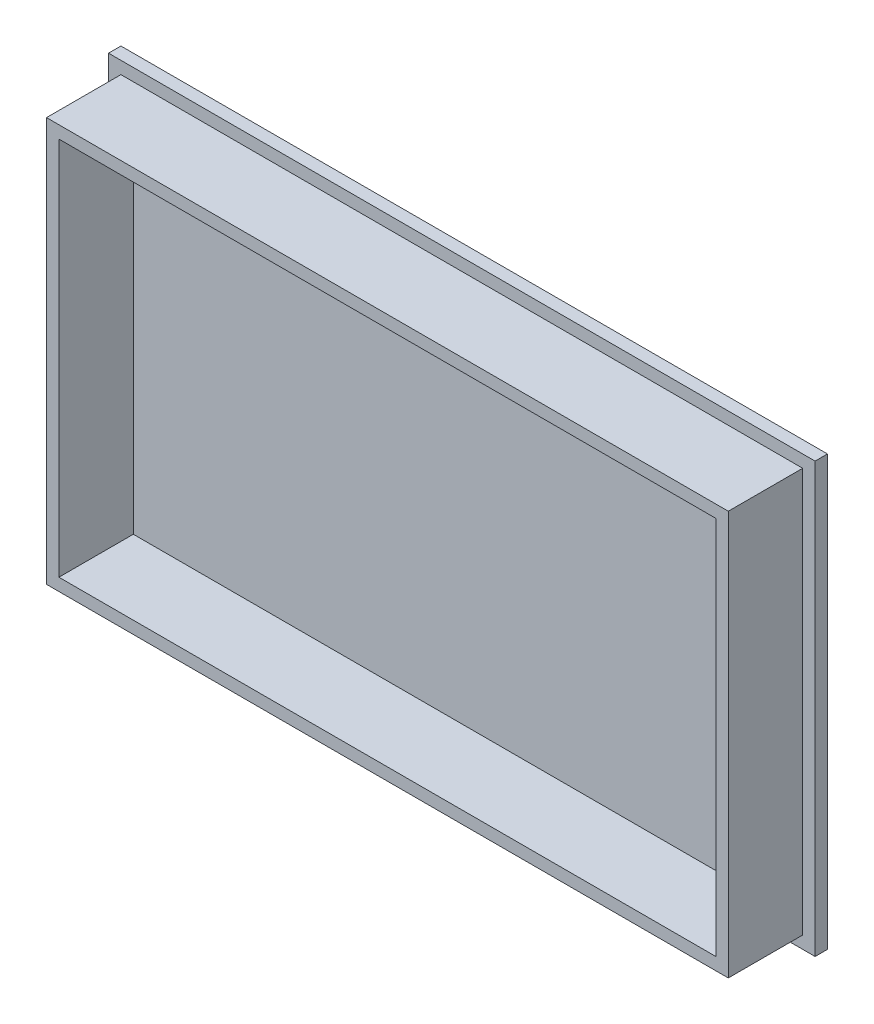
ISO-10303-21;
HEADER;
FILE_DESCRIPTION(('STEP AP214'),'2;1');
FILE_NAME('part.step','',(''),(''),'','','');
FILE_SCHEMA(('AUTOMOTIVE_DESIGN { 1 0 10303 214 1 1 1 1 }'));
ENDSEC;
DATA;
#1=APPLICATION_CONTEXT('core data for automotive mechanical design processes');
#2=APPLICATION_PROTOCOL_DEFINITION('international standard','automotive_design',2000,#1);
#3=PRODUCT_CONTEXT('',#1,'mechanical');
#4=PRODUCT('Part','Part','',(#3));
#5=PRODUCT_RELATED_PRODUCT_CATEGORY('part','',(#4));
#6=PRODUCT_DEFINITION_FORMATION('','',#4);
#7=PRODUCT_DEFINITION_CONTEXT('part definition',#1,'design');
#8=PRODUCT_DEFINITION('design','',#6,#7);
#9=PRODUCT_DEFINITION_SHAPE('','',#8);
#10=(LENGTH_UNIT() NAMED_UNIT(*) SI_UNIT(.MILLI.,.METRE.));
#11=(NAMED_UNIT(*) PLANE_ANGLE_UNIT() SI_UNIT($,.RADIAN.));
#12=(NAMED_UNIT(*) SI_UNIT($,.STERADIAN.) SOLID_ANGLE_UNIT());
#13=UNCERTAINTY_MEASURE_WITH_UNIT(LENGTH_MEASURE(1.E-05),#10,'distance_accuracy_value','');
#14=(GEOMETRIC_REPRESENTATION_CONTEXT(3) GLOBAL_UNCERTAINTY_ASSIGNED_CONTEXT((#13)) GLOBAL_UNIT_ASSIGNED_CONTEXT((#10,
#11,#12)) REPRESENTATION_CONTEXT('',''));
#15=CARTESIAN_POINT('',(0.,0.,0.));
#16=DIRECTION('',(0.,0.,1.));
#17=DIRECTION('',(1.,0.,0.));
#18=AXIS2_PLACEMENT_3D('',#15,#16,#17);
#19=CARTESIAN_POINT('',(-136.627057201795,69.8390557939914,5.));
#20=DIRECTION('',(1.,0.,0.));
#21=DIRECTION('',(0.,1.,0.));
#22=AXIS2_PLACEMENT_3D('',#19,#20,#21);
#23=PLANE('',#22);
#24=DIRECTION('',(0.,-1.,0.));
#25=VECTOR('',#24,1.);
#26=CARTESIAN_POINT('',(-136.627057201795,69.8390557939914,0.));
#27=LINE('',#26,#25);
#28=CARTESIAN_POINT('',(-136.627057201795,69.8390557939914,0.));
#29=VERTEX_POINT('',#28);
#30=CARTESIAN_POINT('',(-136.627057201795,-103.160944206009,0.));
#31=VERTEX_POINT('',#30);
#32=EDGE_CURVE('E224',#29,#31,#27,.T.);
#33=ORIENTED_EDGE('',*,*,#32,.T.);
#34=DIRECTION('',(0.,0.,-1.));
#35=VECTOR('',#34,1.);
#36=CARTESIAN_POINT('',(-136.627057201795,-103.160944206009,5.));
#37=LINE('',#36,#35);
#38=CARTESIAN_POINT('',(-136.627057201795,-103.160944206009,5.));
#39=VERTEX_POINT('',#38);
#40=EDGE_CURVE('E11',#39,#31,#37,.T.);
#41=ORIENTED_EDGE('',*,*,#40,.F.);
#42=DIRECTION('',(0.,-1.,0.));
#43=VECTOR('',#42,1.);
#44=CARTESIAN_POINT('',(-136.627057201795,69.8390557939914,5.));
#45=LINE('',#44,#43);
#46=CARTESIAN_POINT('',(-136.627057201795,69.8390557939914,5.));
#47=VERTEX_POINT('',#46);
#48=EDGE_CURVE('E225',#47,#39,#45,.T.);
#49=ORIENTED_EDGE('',*,*,#48,.F.);
#50=DIRECTION('',(0.,0.,-1.));
#51=VECTOR('',#50,1.);
#52=CARTESIAN_POINT('',(-136.627057201795,69.8390557939914,5.));
#53=LINE('',#52,#51);
#54=EDGE_CURVE('E239',#47,#29,#53,.T.);
#55=ORIENTED_EDGE('',*,*,#54,.T.);
#56=EDGE_LOOP('',(#33,#41,#49,#55));
#57=FACE_BOUND('',#56,.T.);
#58=ADVANCED_FACE('F43',(#57),#23,.F.);
#59=CARTESIAN_POINT('',(-136.627057201795,-103.160944206009,5.));
#60=DIRECTION('',(0.,1.,0.));
#61=DIRECTION('',(0.,0.,1.));
#62=AXIS2_PLACEMENT_3D('',#59,#60,#61);
#63=PLANE('',#62);
#64=DIRECTION('',(1.,0.,0.));
#65=VECTOR('',#64,1.);
#66=CARTESIAN_POINT('',(-136.627057201795,-103.160944206009,0.));
#67=LINE('',#66,#65);
#68=CARTESIAN_POINT('',(148.272942798205,-103.160944206009,0.));
#69=VERTEX_POINT('',#68);
#70=EDGE_CURVE('E243',#31,#69,#67,.T.);
#71=ORIENTED_EDGE('',*,*,#70,.T.);
#72=DIRECTION('',(0.,0.,-1.));
#73=VECTOR('',#72,1.);
#74=CARTESIAN_POINT('',(148.272942798205,-103.160944206009,5.));
#75=LINE('',#74,#73);
#76=CARTESIAN_POINT('',(148.272942798205,-103.160944206009,5.));
#77=VERTEX_POINT('',#76);
#78=EDGE_CURVE('E51',#77,#69,#75,.T.);
#79=ORIENTED_EDGE('',*,*,#78,.F.);
#80=DIRECTION('',(1.,0.,0.));
#81=VECTOR('',#80,1.);
#82=CARTESIAN_POINT('',(-136.627057201795,-103.160944206009,5.));
#83=LINE('',#82,#81);
#84=EDGE_CURVE('E229',#39,#77,#83,.T.);
#85=ORIENTED_EDGE('',*,*,#84,.F.);
#86=ORIENTED_EDGE('',*,*,#40,.T.);
#87=EDGE_LOOP('',(#71,#79,#85,#86));
#88=FACE_BOUND('',#87,.T.);
#89=ADVANCED_FACE('F279',(#88),#63,.F.);
#90=CARTESIAN_POINT('',(148.272942798205,69.8390557939914,5.));
#91=DIRECTION('',(-1.,0.,0.));
#92=DIRECTION('',(0.,0.,1.));
#93=AXIS2_PLACEMENT_3D('',#90,#91,#92);
#94=PLANE('',#93);
#95=DIRECTION('',(0.,1.,0.));
#96=VECTOR('',#95,1.);
#97=CARTESIAN_POINT('',(148.272942798205,69.8390557939914,0.));
#98=LINE('',#97,#96);
#99=CARTESIAN_POINT('',(148.272942798205,69.8390557939914,0.));
#100=VERTEX_POINT('',#99);
#101=EDGE_CURVE('E246',#69,#100,#98,.T.);
#102=ORIENTED_EDGE('',*,*,#101,.T.);
#103=DIRECTION('',(0.,0.,-1.));
#104=VECTOR('',#103,1.);
#105=CARTESIAN_POINT('',(148.272942798205,69.8390557939914,5.));
#106=LINE('',#105,#104);
#107=CARTESIAN_POINT('',(148.272942798205,69.8390557939914,5.));
#108=VERTEX_POINT('',#107);
#109=EDGE_CURVE('E254',#108,#100,#106,.T.);
#110=ORIENTED_EDGE('',*,*,#109,.F.);
#111=DIRECTION('',(0.,1.,0.));
#112=VECTOR('',#111,1.);
#113=CARTESIAN_POINT('',(148.272942798205,69.8390557939914,5.));
#114=LINE('',#113,#112);
#115=EDGE_CURVE('E233',#77,#108,#114,.T.);
#116=ORIENTED_EDGE('',*,*,#115,.F.);
#117=ORIENTED_EDGE('',*,*,#78,.T.);
#118=EDGE_LOOP('',(#102,#110,#116,#117));
#119=FACE_BOUND('',#118,.T.);
#120=ADVANCED_FACE('F263',(#119),#94,.F.);
#121=CARTESIAN_POINT('',(-136.627057201795,69.8390557939914,5.));
#122=DIRECTION('',(0.,-1.,0.));
#123=DIRECTION('',(0.,0.,-1.));
#124=AXIS2_PLACEMENT_3D('',#121,#122,#123);
#125=PLANE('',#124);
#126=DIRECTION('',(-1.,0.,0.));
#127=VECTOR('',#126,1.);
#128=CARTESIAN_POINT('',(-136.627057201795,69.8390557939914,0.));
#129=LINE('',#128,#127);
#130=EDGE_CURVE('E230',#100,#29,#129,.T.);
#131=ORIENTED_EDGE('',*,*,#130,.T.);
#132=ORIENTED_EDGE('',*,*,#54,.F.);
#133=DIRECTION('',(-1.,0.,0.));
#134=VECTOR('',#133,1.);
#135=CARTESIAN_POINT('',(-136.627057201795,69.8390557939914,5.));
#136=LINE('',#135,#134);
#137=EDGE_CURVE('E236',#108,#47,#136,.T.);
#138=ORIENTED_EDGE('',*,*,#137,.F.);
#139=ORIENTED_EDGE('',*,*,#109,.T.);
#140=EDGE_LOOP('',(#131,#132,#138,#139));
#141=FACE_BOUND('',#140,.T.);
#142=ADVANCED_FACE('F272',(#141),#125,.F.);
#143=CARTESIAN_POINT('',(0.,0.,5.));
#144=DIRECTION('',(0.,0.,1.));
#145=DIRECTION('',(1.,0.,0.));
#146=AXIS2_PLACEMENT_3D('',#143,#144,#145);
#147=PLANE('',#146);
#148=DIRECTION('',(0.,-1.,0.));
#149=VECTOR('',#148,1.);
#150=CARTESIAN_POINT('',(-131.627057201795,64.8390557939914,5.));
#151=LINE('',#150,#149);
#152=CARTESIAN_POINT('',(-131.627057201795,64.8390557939914,5.));
#153=VERTEX_POINT('',#152);
#154=CARTESIAN_POINT('',(-131.627057201795,-98.1609442060086,5.));
#155=VERTEX_POINT('',#154);
#156=EDGE_CURVE('E66',#153,#155,#151,.T.);
#157=ORIENTED_EDGE('',*,*,#156,.F.);
#158=DIRECTION('',(-1.,0.,0.));
#159=VECTOR('',#158,1.);
#160=CARTESIAN_POINT('',(-131.627057201795,64.8390557939914,5.));
#161=LINE('',#160,#159);
#162=CARTESIAN_POINT('',(143.272942798205,64.8390557939914,5.));
#163=VERTEX_POINT('',#162);
#164=EDGE_CURVE('E187',#163,#153,#161,.T.);
#165=ORIENTED_EDGE('',*,*,#164,.F.);
#166=DIRECTION('',(0.,1.,0.));
#167=VECTOR('',#166,1.);
#168=CARTESIAN_POINT('',(143.272942798205,64.8390557939914,5.));
#169=LINE('',#168,#167);
#170=CARTESIAN_POINT('',(143.272942798205,-98.1609442060086,5.));
#171=VERTEX_POINT('',#170);
#172=EDGE_CURVE('E203',#171,#163,#169,.T.);
#173=ORIENTED_EDGE('',*,*,#172,.F.);
#174=DIRECTION('',(1.,0.,0.));
#175=VECTOR('',#174,1.);
#176=CARTESIAN_POINT('',(-131.627057201795,-98.1609442060086,5.));
#177=LINE('',#176,#175);
#178=EDGE_CURVE('E199',#155,#171,#177,.T.);
#179=ORIENTED_EDGE('',*,*,#178,.F.);
#180=EDGE_LOOP('',(#157,#165,#173,#179));
#181=FACE_BOUND('',#180,.T.);
#182=ORIENTED_EDGE('',*,*,#48,.T.);
#183=ORIENTED_EDGE('',*,*,#84,.T.);
#184=ORIENTED_EDGE('',*,*,#115,.T.);
#185=ORIENTED_EDGE('',*,*,#137,.T.);
#186=EDGE_LOOP('',(#182,#183,#184,#185));
#187=FACE_BOUND('',#186,.T.);
#188=ADVANCED_FACE('F278',(#181,#187),#147,.T.);
#189=CARTESIAN_POINT('',(0.,0.,0.));
#190=DIRECTION('',(0.,0.,1.));
#191=DIRECTION('',(1.,0.,0.));
#192=AXIS2_PLACEMENT_3D('',#189,#190,#191);
#193=PLANE('',#192);
#194=ORIENTED_EDGE('',*,*,#32,.F.);
#195=ORIENTED_EDGE('',*,*,#130,.F.);
#196=ORIENTED_EDGE('',*,*,#101,.F.);
#197=ORIENTED_EDGE('',*,*,#70,.F.);
#198=EDGE_LOOP('',(#194,#195,#196,#197));
#199=FACE_BOUND('',#198,.T.);
#200=ADVANCED_FACE('F269',(#199),#193,.F.);
#201=CARTESIAN_POINT('',(-131.627057201795,64.8390557939914,35.));
#202=DIRECTION('',(1.,0.,0.));
#203=DIRECTION('',(0.,1.,0.));
#204=AXIS2_PLACEMENT_3D('',#201,#202,#203);
#205=PLANE('',#204);
#206=ORIENTED_EDGE('',*,*,#156,.T.);
#207=DIRECTION('',(0.,0.,-1.));
#208=VECTOR('',#207,1.);
#209=CARTESIAN_POINT('',(-131.627057201795,-98.1609442060086,35.));
#210=LINE('',#209,#208);
#211=CARTESIAN_POINT('',(-131.627057201795,-98.1609442060086,35.));
#212=VERTEX_POINT('',#211);
#213=EDGE_CURVE('E220',#212,#155,#210,.T.);
#214=ORIENTED_EDGE('',*,*,#213,.F.);
#215=DIRECTION('',(0.,-1.,0.));
#216=VECTOR('',#215,1.);
#217=CARTESIAN_POINT('',(-131.627057201795,64.8390557939914,35.));
#218=LINE('',#217,#216);
#219=CARTESIAN_POINT('',(-131.627057201795,64.8390557939914,35.));
#220=VERTEX_POINT('',#219);
#221=EDGE_CURVE('E182',#220,#212,#218,.T.);
#222=ORIENTED_EDGE('',*,*,#221,.F.);
#223=DIRECTION('',(0.,0.,-1.));
#224=VECTOR('',#223,1.);
#225=CARTESIAN_POINT('',(-131.627057201795,64.8390557939914,35.));
#226=LINE('',#225,#224);
#227=EDGE_CURVE('E196',#220,#153,#226,.T.);
#228=ORIENTED_EDGE('',*,*,#227,.T.);
#229=EDGE_LOOP('',(#206,#214,#222,#228));
#230=FACE_BOUND('',#229,.T.);
#231=ADVANCED_FACE('F291',(#230),#205,.F.);
#232=CARTESIAN_POINT('',(-131.627057201795,-98.1609442060086,35.));
#233=DIRECTION('',(0.,1.,0.));
#234=DIRECTION('',(0.,0.,1.));
#235=AXIS2_PLACEMENT_3D('',#232,#233,#234);
#236=PLANE('',#235);
#237=ORIENTED_EDGE('',*,*,#178,.T.);
#238=DIRECTION('',(0.,0.,-1.));
#239=VECTOR('',#238,1.);
#240=CARTESIAN_POINT('',(143.272942798205,-98.1609442060086,35.));
#241=LINE('',#240,#239);
#242=CARTESIAN_POINT('',(143.272942798205,-98.1609442060086,35.));
#243=VERTEX_POINT('',#242);
#244=EDGE_CURVE('E216',#243,#171,#241,.T.);
#245=ORIENTED_EDGE('',*,*,#244,.F.);
#246=DIRECTION('',(1.,0.,0.));
#247=VECTOR('',#246,1.);
#248=CARTESIAN_POINT('',(-131.627057201795,-98.1609442060086,35.));
#249=LINE('',#248,#247);
#250=EDGE_CURVE('E186',#212,#243,#249,.T.);
#251=ORIENTED_EDGE('',*,*,#250,.F.);
#252=ORIENTED_EDGE('',*,*,#213,.T.);
#253=EDGE_LOOP('',(#237,#245,#251,#252));
#254=FACE_BOUND('',#253,.T.);
#255=ADVANCED_FACE('F296',(#254),#236,.F.);
#256=CARTESIAN_POINT('',(143.272942798205,64.8390557939914,35.));
#257=DIRECTION('',(-1.,0.,0.));
#258=DIRECTION('',(0.,-1.,0.));
#259=AXIS2_PLACEMENT_3D('',#256,#257,#258);
#260=PLANE('',#259);
#261=ORIENTED_EDGE('',*,*,#172,.T.);
#262=DIRECTION('',(0.,0.,-1.));
#263=VECTOR('',#262,1.);
#264=CARTESIAN_POINT('',(143.272942798205,64.8390557939914,35.));
#265=LINE('',#264,#263);
#266=CARTESIAN_POINT('',(143.272942798205,64.8390557939914,35.));
#267=VERTEX_POINT('',#266);
#268=EDGE_CURVE('E212',#267,#163,#265,.T.);
#269=ORIENTED_EDGE('',*,*,#268,.F.);
#270=DIRECTION('',(0.,1.,0.));
#271=VECTOR('',#270,1.);
#272=CARTESIAN_POINT('',(143.272942798205,64.8390557939914,35.));
#273=LINE('',#272,#271);
#274=EDGE_CURVE('E190',#243,#267,#273,.T.);
#275=ORIENTED_EDGE('',*,*,#274,.F.);
#276=ORIENTED_EDGE('',*,*,#244,.T.);
#277=EDGE_LOOP('',(#261,#269,#275,#276));
#278=FACE_BOUND('',#277,.T.);
#279=ADVANCED_FACE('F300',(#278),#260,.F.);
#280=CARTESIAN_POINT('',(-131.627057201795,64.8390557939914,35.));
#281=DIRECTION('',(0.,-1.,0.));
#282=DIRECTION('',(0.,0.,-1.));
#283=AXIS2_PLACEMENT_3D('',#280,#281,#282);
#284=PLANE('',#283);
#285=ORIENTED_EDGE('',*,*,#164,.T.);
#286=ORIENTED_EDGE('',*,*,#227,.F.);
#287=DIRECTION('',(-1.,0.,0.));
#288=VECTOR('',#287,1.);
#289=CARTESIAN_POINT('',(-131.627057201795,64.8390557939914,35.));
#290=LINE('',#289,#288);
#291=EDGE_CURVE('E193',#267,#220,#290,.T.);
#292=ORIENTED_EDGE('',*,*,#291,.F.);
#293=ORIENTED_EDGE('',*,*,#268,.T.);
#294=EDGE_LOOP('',(#285,#286,#292,#293));
#295=FACE_BOUND('',#294,.T.);
#296=ADVANCED_FACE('F304',(#295),#284,.F.);
#297=CARTESIAN_POINT('',(0.,0.,35.));
#298=DIRECTION('',(0.,0.,1.));
#299=DIRECTION('',(1.,0.,0.));
#300=AXIS2_PLACEMENT_3D('',#297,#298,#299);
#301=PLANE('',#300);
#302=DIRECTION('',(0.,-1.,0.));
#303=VECTOR('',#302,1.);
#304=CARTESIAN_POINT('',(-126.627057201795,59.8390557939914,35.));
#305=LINE('',#304,#303);
#306=CARTESIAN_POINT('',(-126.627057201795,59.8390557939914,35.));
#307=VERTEX_POINT('',#306);
#308=CARTESIAN_POINT('',(-126.627057201795,-93.1609442060086,35.));
#309=VERTEX_POINT('',#308);
#310=EDGE_CURVE('E58',#307,#309,#305,.T.);
#311=ORIENTED_EDGE('',*,*,#310,.F.);
#312=DIRECTION('',(-1.,0.,0.));
#313=VECTOR('',#312,1.);
#314=CARTESIAN_POINT('',(-126.627057201795,59.8390557939914,35.));
#315=LINE('',#314,#313);
#316=CARTESIAN_POINT('',(138.272942798205,59.8390557939914,35.));
#317=VERTEX_POINT('',#316);
#318=EDGE_CURVE('E155',#317,#307,#315,.T.);
#319=ORIENTED_EDGE('',*,*,#318,.F.);
#320=DIRECTION('',(0.,1.,0.));
#321=VECTOR('',#320,1.);
#322=CARTESIAN_POINT('',(138.272942798205,59.8390557939914,35.));
#323=LINE('',#322,#321);
#324=CARTESIAN_POINT('',(138.272942798205,-93.1609442060086,35.));
#325=VERTEX_POINT('',#324);
#326=EDGE_CURVE('E159',#325,#317,#323,.T.);
#327=ORIENTED_EDGE('',*,*,#326,.F.);
#328=DIRECTION('',(1.,0.,0.));
#329=VECTOR('',#328,1.);
#330=CARTESIAN_POINT('',(-126.627057201795,-93.1609442060086,35.));
#331=LINE('',#330,#329);
#332=EDGE_CURVE('E168',#309,#325,#331,.T.);
#333=ORIENTED_EDGE('',*,*,#332,.F.);
#334=EDGE_LOOP('',(#311,#319,#327,#333));
#335=FACE_BOUND('',#334,.T.);
#336=ORIENTED_EDGE('',*,*,#221,.T.);
#337=ORIENTED_EDGE('',*,*,#250,.T.);
#338=ORIENTED_EDGE('',*,*,#274,.T.);
#339=ORIENTED_EDGE('',*,*,#291,.T.);
#340=EDGE_LOOP('',(#336,#337,#338,#339));
#341=FACE_BOUND('',#340,.T.);
#342=ADVANCED_FACE('F308',(#335,#341),#301,.T.);
#343=CARTESIAN_POINT('',(-126.627057201795,59.8390557939914,5.));
#344=DIRECTION('',(-1.,0.,0.));
#345=DIRECTION('',(0.,-1.,0.));
#346=AXIS2_PLACEMENT_3D('',#343,#344,#345);
#347=PLANE('',#346);
#348=ORIENTED_EDGE('',*,*,#310,.T.);
#349=DIRECTION('',(0.,0.,1.));
#350=VECTOR('',#349,1.);
#351=CARTESIAN_POINT('',(-126.627057201795,-93.1609442060086,5.));
#352=LINE('',#351,#350);
#353=CARTESIAN_POINT('',(-126.627057201795,-93.1609442060086,5.));
#354=VERTEX_POINT('',#353);
#355=EDGE_CURVE('E130',#354,#309,#352,.T.);
#356=ORIENTED_EDGE('',*,*,#355,.F.);
#357=DIRECTION('',(0.,-1.,0.));
#358=VECTOR('',#357,1.);
#359=CARTESIAN_POINT('',(-126.627057201795,59.8390557939914,5.));
#360=LINE('',#359,#358);
#361=CARTESIAN_POINT('',(-126.627057201795,59.8390557939914,5.));
#362=VERTEX_POINT('',#361);
#363=EDGE_CURVE('E134',#362,#354,#360,.T.);
#364=ORIENTED_EDGE('',*,*,#363,.F.);
#365=DIRECTION('',(0.,0.,1.));
#366=VECTOR('',#365,1.);
#367=CARTESIAN_POINT('',(-126.627057201795,59.8390557939914,5.));
#368=LINE('',#367,#366);
#369=EDGE_CURVE('E174',#362,#307,#368,.T.);
#370=ORIENTED_EDGE('',*,*,#369,.T.);
#371=EDGE_LOOP('',(#348,#356,#364,#370));
#372=FACE_BOUND('',#371,.T.);
#373=ADVANCED_FACE('F132',(#372),#347,.F.);
#374=CARTESIAN_POINT('',(-126.627057201795,59.8390557939914,5.));
#375=DIRECTION('',(0.,1.,0.));
#376=DIRECTION('',(0.,0.,1.));
#377=AXIS2_PLACEMENT_3D('',#374,#375,#376);
#378=PLANE('',#377);
#379=ORIENTED_EDGE('',*,*,#318,.T.);
#380=ORIENTED_EDGE('',*,*,#369,.F.);
#381=DIRECTION('',(-1.,0.,0.));
#382=VECTOR('',#381,1.);
#383=CARTESIAN_POINT('',(-126.627057201795,59.8390557939914,5.));
#384=LINE('',#383,#382);
#385=CARTESIAN_POINT('',(138.272942798205,59.8390557939914,5.));
#386=VERTEX_POINT('',#385);
#387=EDGE_CURVE('E141',#386,#362,#384,.T.);
#388=ORIENTED_EDGE('',*,*,#387,.F.);
#389=DIRECTION('',(0.,0.,1.));
#390=VECTOR('',#389,1.);
#391=CARTESIAN_POINT('',(138.272942798205,59.8390557939914,5.));
#392=LINE('',#391,#390);
#393=EDGE_CURVE('E177',#386,#317,#392,.T.);
#394=ORIENTED_EDGE('',*,*,#393,.T.);
#395=EDGE_LOOP('',(#379,#380,#388,#394));
#396=FACE_BOUND('',#395,.T.);
#397=ADVANCED_FACE('F315',(#396),#378,.F.);
#398=CARTESIAN_POINT('',(138.272942798205,59.8390557939914,5.));
#399=DIRECTION('',(1.,0.,0.));
#400=DIRECTION('',(0.,0.,-1.));
#401=AXIS2_PLACEMENT_3D('',#398,#399,#400);
#402=PLANE('',#401);
#403=ORIENTED_EDGE('',*,*,#326,.T.);
#404=ORIENTED_EDGE('',*,*,#393,.F.);
#405=DIRECTION('',(0.,1.,0.));
#406=VECTOR('',#405,1.);
#407=CARTESIAN_POINT('',(138.272942798205,59.8390557939914,5.));
#408=LINE('',#407,#406);
#409=CARTESIAN_POINT('',(138.272942798205,-93.1609442060086,5.));
#410=VERTEX_POINT('',#409);
#411=EDGE_CURVE('E150',#410,#386,#408,.T.);
#412=ORIENTED_EDGE('',*,*,#411,.F.);
#413=DIRECTION('',(0.,0.,1.));
#414=VECTOR('',#413,1.);
#415=CARTESIAN_POINT('',(138.272942798205,-93.1609442060086,5.));
#416=LINE('',#415,#414);
#417=EDGE_CURVE('E140',#410,#325,#416,.T.);
#418=ORIENTED_EDGE('',*,*,#417,.T.);
#419=EDGE_LOOP('',(#403,#404,#412,#418));
#420=FACE_BOUND('',#419,.T.);
#421=ADVANCED_FACE('F318',(#420),#402,.F.);
#422=CARTESIAN_POINT('',(-126.627057201795,-93.1609442060086,5.));
#423=DIRECTION('',(0.,-1.,0.));
#424=DIRECTION('',(0.,0.,-1.));
#425=AXIS2_PLACEMENT_3D('',#422,#423,#424);
#426=PLANE('',#425);
#427=ORIENTED_EDGE('',*,*,#332,.T.);
#428=ORIENTED_EDGE('',*,*,#417,.F.);
#429=DIRECTION('',(1.,0.,0.));
#430=VECTOR('',#429,1.);
#431=CARTESIAN_POINT('',(-126.627057201795,-93.1609442060086,5.));
#432=LINE('',#431,#430);
#433=EDGE_CURVE('E144',#354,#410,#432,.T.);
#434=ORIENTED_EDGE('',*,*,#433,.F.);
#435=ORIENTED_EDGE('',*,*,#355,.T.);
#436=EDGE_LOOP('',(#427,#428,#434,#435));
#437=FACE_BOUND('',#436,.T.);
#438=ADVANCED_FACE('F145',(#437),#426,.F.);
#439=CARTESIAN_POINT('',(0.,0.,5.));
#440=DIRECTION('',(0.,0.,1.));
#441=DIRECTION('',(1.,0.,0.));
#442=AXIS2_PLACEMENT_3D('',#439,#440,#441);
#443=PLANE('',#442);
#444=ORIENTED_EDGE('',*,*,#363,.T.);
#445=ORIENTED_EDGE('',*,*,#433,.T.);
#446=ORIENTED_EDGE('',*,*,#411,.T.);
#447=ORIENTED_EDGE('',*,*,#387,.T.);
#448=EDGE_LOOP('',(#444,#445,#446,#447));
#449=FACE_BOUND('',#448,.T.);
#450=ADVANCED_FACE('F152',(#449),#443,.T.);
#451=CLOSED_SHELL('',(#58,#89,#120,#142,#188,#200,#231,#255,#279,#296,#342,#373,#397,#421,#438,#450));
#452=MANIFOLD_SOLID_BREP('B2',#451);
#453=ADVANCED_BREP_SHAPE_REPRESENTATION('',(#18,#452),#14);
#454=SHAPE_DEFINITION_REPRESENTATION(#9,#453);
ENDSEC;
END-ISO-10303-21;
